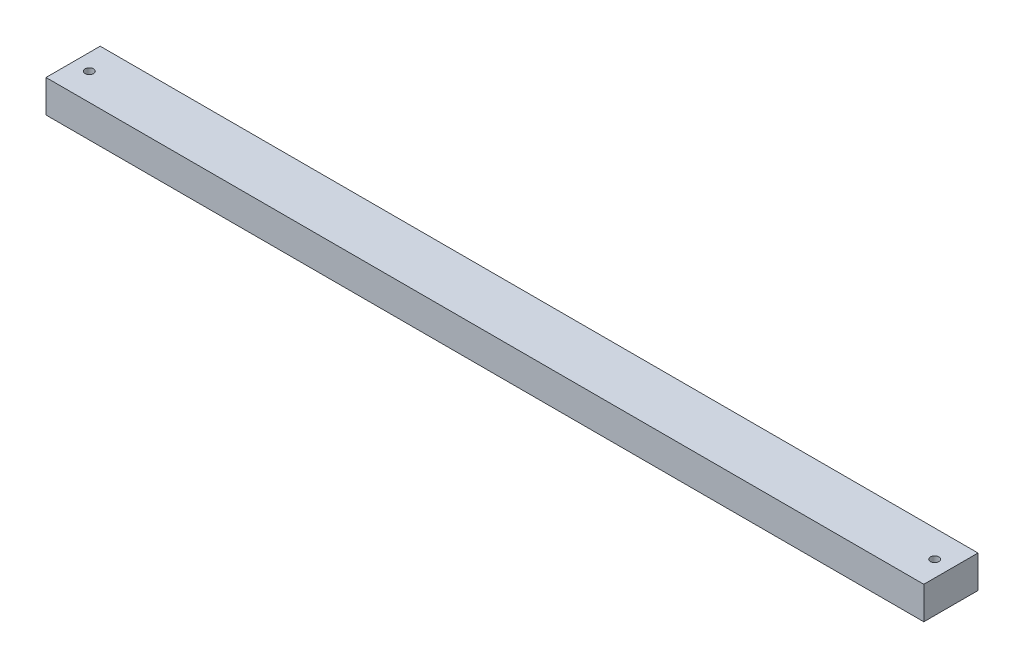
ISO-10303-21;
HEADER;
FILE_DESCRIPTION(('STEP AP214'),'2;1');
FILE_NAME('part.step','',(''),(''),'','','');
FILE_SCHEMA(('AUTOMOTIVE_DESIGN { 1 0 10303 214 1 1 1 1 }'));
ENDSEC;
DATA;
#1=APPLICATION_CONTEXT('core data for automotive mechanical design processes');
#2=APPLICATION_PROTOCOL_DEFINITION('international standard','automotive_design',2000,#1);
#3=PRODUCT_CONTEXT('',#1,'mechanical');
#4=PRODUCT('Part','Part','',(#3));
#5=PRODUCT_RELATED_PRODUCT_CATEGORY('part','',(#4));
#6=PRODUCT_DEFINITION_FORMATION('','',#4);
#7=PRODUCT_DEFINITION_CONTEXT('part definition',#1,'design');
#8=PRODUCT_DEFINITION('design','',#6,#7);
#9=PRODUCT_DEFINITION_SHAPE('','',#8);
#10=(LENGTH_UNIT() NAMED_UNIT(*) SI_UNIT(.MILLI.,.METRE.));
#11=(NAMED_UNIT(*) PLANE_ANGLE_UNIT() SI_UNIT($,.RADIAN.));
#12=(NAMED_UNIT(*) SI_UNIT($,.STERADIAN.) SOLID_ANGLE_UNIT());
#13=UNCERTAINTY_MEASURE_WITH_UNIT(LENGTH_MEASURE(1.E-05),#10,'distance_accuracy_value','');
#14=(GEOMETRIC_REPRESENTATION_CONTEXT(3) GLOBAL_UNCERTAINTY_ASSIGNED_CONTEXT((#13)) GLOBAL_UNIT_ASSIGNED_CONTEXT((#10,
#11,#12)) REPRESENTATION_CONTEXT('',''));
#15=CARTESIAN_POINT('',(0.,0.,0.));
#16=DIRECTION('',(0.,0.,1.));
#17=DIRECTION('',(1.,0.,0.));
#18=AXIS2_PLACEMENT_3D('',#15,#16,#17);
#19=CARTESIAN_POINT('',(162.,12.,-10.));
#20=DIRECTION('',(-1.,0.,0.));
#21=DIRECTION('',(0.,0.,1.));
#22=AXIS2_PLACEMENT_3D('',#19,#20,#21);
#23=PLANE('',#22);
#24=DIRECTION('',(0.,0.,-1.));
#25=VECTOR('',#24,1.);
#26=CARTESIAN_POINT('',(162.,0.,-10.));
#27=LINE('',#26,#25);
#28=CARTESIAN_POINT('',(162.,0.,10.));
#29=VERTEX_POINT('',#28);
#30=CARTESIAN_POINT('',(162.,0.,-10.));
#31=VERTEX_POINT('',#30);
#32=EDGE_CURVE('E96',#29,#31,#27,.T.);
#33=ORIENTED_EDGE('',*,*,#32,.T.);
#34=DIRECTION('',(0.,-1.,0.));
#35=VECTOR('',#34,1.);
#36=CARTESIAN_POINT('',(162.,12.,-10.));
#37=LINE('',#36,#35);
#38=CARTESIAN_POINT('',(162.,12.,-10.));
#39=VERTEX_POINT('',#38);
#40=EDGE_CURVE('E11',#39,#31,#37,.T.);
#41=ORIENTED_EDGE('',*,*,#40,.F.);
#42=DIRECTION('',(0.,0.,-1.));
#43=VECTOR('',#42,1.);
#44=CARTESIAN_POINT('',(162.,12.,-10.));
#45=LINE('',#44,#43);
#46=CARTESIAN_POINT('',(162.,12.,10.));
#47=VERTEX_POINT('',#46);
#48=EDGE_CURVE('E84',#47,#39,#45,.T.);
#49=ORIENTED_EDGE('',*,*,#48,.F.);
#50=DIRECTION('',(0.,-1.,0.));
#51=VECTOR('',#50,1.);
#52=CARTESIAN_POINT('',(162.,12.,10.));
#53=LINE('',#52,#51);
#54=EDGE_CURVE('E92',#47,#29,#53,.T.);
#55=ORIENTED_EDGE('',*,*,#54,.T.);
#56=EDGE_LOOP('',(#33,#41,#49,#55));
#57=FACE_BOUND('',#56,.T.);
#58=ADVANCED_FACE('F33',(#57),#23,.F.);
#59=CARTESIAN_POINT('',(-162.,12.,-10.));
#60=DIRECTION('',(0.,0.,1.));
#61=DIRECTION('',(1.,0.,0.));
#62=AXIS2_PLACEMENT_3D('',#59,#60,#61);
#63=PLANE('',#62);
#64=DIRECTION('',(-1.,0.,0.));
#65=VECTOR('',#64,1.);
#66=CARTESIAN_POINT('',(-162.,0.,-10.));
#67=LINE('',#66,#65);
#68=CARTESIAN_POINT('',(-162.,0.,-10.));
#69=VERTEX_POINT('',#68);
#70=EDGE_CURVE('E88',#31,#69,#67,.T.);
#71=ORIENTED_EDGE('',*,*,#70,.T.);
#72=DIRECTION('',(0.,-1.,0.));
#73=VECTOR('',#72,1.);
#74=CARTESIAN_POINT('',(-162.,12.,-10.));
#75=LINE('',#74,#73);
#76=CARTESIAN_POINT('',(-162.,12.,-10.));
#77=VERTEX_POINT('',#76);
#78=EDGE_CURVE('E41',#77,#69,#75,.T.);
#79=ORIENTED_EDGE('',*,*,#78,.F.);
#80=DIRECTION('',(-1.,0.,0.));
#81=VECTOR('',#80,1.);
#82=CARTESIAN_POINT('',(-162.,12.,-10.));
#83=LINE('',#82,#81);
#84=EDGE_CURVE('E79',#39,#77,#83,.T.);
#85=ORIENTED_EDGE('',*,*,#84,.F.);
#86=ORIENTED_EDGE('',*,*,#40,.T.);
#87=EDGE_LOOP('',(#71,#79,#85,#86));
#88=FACE_BOUND('',#87,.T.);
#89=ADVANCED_FACE('F87',(#88),#63,.F.);
#90=CARTESIAN_POINT('',(-162.,12.,-10.));
#91=DIRECTION('',(1.,0.,0.));
#92=DIRECTION('',(0.,0.,-1.));
#93=AXIS2_PLACEMENT_3D('',#90,#91,#92);
#94=PLANE('',#93);
#95=DIRECTION('',(0.,0.,1.));
#96=VECTOR('',#95,1.);
#97=CARTESIAN_POINT('',(-162.,0.,-10.));
#98=LINE('',#97,#96);
#99=CARTESIAN_POINT('',(-162.,0.,10.));
#100=VERTEX_POINT('',#99);
#101=EDGE_CURVE('E66',#69,#100,#98,.T.);
#102=ORIENTED_EDGE('',*,*,#101,.T.);
#103=DIRECTION('',(0.,-1.,0.));
#104=VECTOR('',#103,1.);
#105=CARTESIAN_POINT('',(-162.,12.,10.));
#106=LINE('',#105,#104);
#107=CARTESIAN_POINT('',(-162.,12.,10.));
#108=VERTEX_POINT('',#107);
#109=EDGE_CURVE('E89',#108,#100,#106,.T.);
#110=ORIENTED_EDGE('',*,*,#109,.F.);
#111=DIRECTION('',(0.,0.,1.));
#112=VECTOR('',#111,1.);
#113=CARTESIAN_POINT('',(-162.,12.,-10.));
#114=LINE('',#113,#112);
#115=EDGE_CURVE('E82',#77,#108,#114,.T.);
#116=ORIENTED_EDGE('',*,*,#115,.F.);
#117=ORIENTED_EDGE('',*,*,#78,.T.);
#118=EDGE_LOOP('',(#102,#110,#116,#117));
#119=FACE_BOUND('',#118,.T.);
#120=ADVANCED_FACE('F90',(#119),#94,.F.);
#121=CARTESIAN_POINT('',(-162.,12.,10.));
#122=DIRECTION('',(0.,0.,-1.));
#123=DIRECTION('',(-1.,0.,0.));
#124=AXIS2_PLACEMENT_3D('',#121,#122,#123);
#125=PLANE('',#124);
#126=DIRECTION('',(1.,0.,0.));
#127=VECTOR('',#126,1.);
#128=CARTESIAN_POINT('',(-162.,0.,10.));
#129=LINE('',#128,#127);
#130=EDGE_CURVE('E72',#100,#29,#129,.T.);
#131=ORIENTED_EDGE('',*,*,#130,.T.);
#132=ORIENTED_EDGE('',*,*,#54,.F.);
#133=DIRECTION('',(1.,0.,0.));
#134=VECTOR('',#133,1.);
#135=CARTESIAN_POINT('',(-162.,12.,10.));
#136=LINE('',#135,#134);
#137=EDGE_CURVE('E49',#108,#47,#136,.T.);
#138=ORIENTED_EDGE('',*,*,#137,.F.);
#139=ORIENTED_EDGE('',*,*,#109,.T.);
#140=EDGE_LOOP('',(#131,#132,#138,#139));
#141=FACE_BOUND('',#140,.T.);
#142=ADVANCED_FACE('F104',(#141),#125,.F.);
#143=CARTESIAN_POINT('',(0.,12.,0.));
#144=DIRECTION('',(0.,1.,0.));
#145=DIRECTION('',(0.,0.,1.));
#146=AXIS2_PLACEMENT_3D('',#143,#144,#145);
#147=PLANE('',#146);
#148=CARTESIAN_POINT('',(156.,12.,0.));
#149=DIRECTION('',(0.,1.,0.));
#150=DIRECTION('',(0.,0.,1.));
#151=AXIS2_PLACEMENT_3D('',#148,#149,#150);
#152=CIRCLE('',#151,1.54999999999999);
#153=CARTESIAN_POINT('',(156.,12.,1.54999999999999));
#154=VERTEX_POINT('',#153);
#155=EDGE_CURVE('E116',#154,#154,#152,.T.);
#156=ORIENTED_EDGE('',*,*,#155,.F.);
#157=EDGE_LOOP('',(#156));
#158=FACE_BOUND('',#157,.T.);
#159=CARTESIAN_POINT('',(-156.,12.,0.));
#160=DIRECTION('',(0.,1.,0.));
#161=DIRECTION('',(0.,0.,1.));
#162=AXIS2_PLACEMENT_3D('',#159,#160,#161);
#163=CIRCLE('',#162,1.54999999999999);
#164=CARTESIAN_POINT('',(-156.,12.,1.54999999999999));
#165=VERTEX_POINT('',#164);
#166=EDGE_CURVE('E110',#165,#165,#163,.T.);
#167=ORIENTED_EDGE('',*,*,#166,.F.);
#168=EDGE_LOOP('',(#167));
#169=FACE_BOUND('',#168,.T.);
#170=ORIENTED_EDGE('',*,*,#48,.T.);
#171=ORIENTED_EDGE('',*,*,#84,.T.);
#172=ORIENTED_EDGE('',*,*,#115,.T.);
#173=ORIENTED_EDGE('',*,*,#137,.T.);
#174=EDGE_LOOP('',(#170,#171,#172,#173));
#175=FACE_BOUND('',#174,.T.);
#176=ADVANCED_FACE('F80',(#158,#169,#175),#147,.T.);
#177=CARTESIAN_POINT('',(0.,0.,0.));
#178=DIRECTION('',(0.,1.,0.));
#179=DIRECTION('',(0.,0.,1.));
#180=AXIS2_PLACEMENT_3D('',#177,#178,#179);
#181=PLANE('',#180);
#182=CARTESIAN_POINT('',(156.,0.,0.));
#183=DIRECTION('',(0.,1.,0.));
#184=DIRECTION('',(0.,0.,1.));
#185=AXIS2_PLACEMENT_3D('',#182,#183,#184);
#186=CIRCLE('',#185,1.54999999999999);
#187=CARTESIAN_POINT('',(156.,0.,1.54999999999999));
#188=VERTEX_POINT('',#187);
#189=EDGE_CURVE('E113',#188,#188,#186,.T.);
#190=ORIENTED_EDGE('',*,*,#189,.T.);
#191=EDGE_LOOP('',(#190));
#192=FACE_BOUND('',#191,.T.);
#193=CARTESIAN_POINT('',(-156.,0.,0.));
#194=DIRECTION('',(0.,1.,0.));
#195=DIRECTION('',(0.,0.,1.));
#196=AXIS2_PLACEMENT_3D('',#193,#194,#195);
#197=CIRCLE('',#196,1.54999999999999);
#198=CARTESIAN_POINT('',(-156.,0.,1.54999999999999));
#199=VERTEX_POINT('',#198);
#200=EDGE_CURVE('E99',#199,#199,#197,.T.);
#201=ORIENTED_EDGE('',*,*,#200,.T.);
#202=EDGE_LOOP('',(#201));
#203=FACE_BOUND('',#202,.T.);
#204=ORIENTED_EDGE('',*,*,#32,.F.);
#205=ORIENTED_EDGE('',*,*,#130,.F.);
#206=ORIENTED_EDGE('',*,*,#101,.F.);
#207=ORIENTED_EDGE('',*,*,#70,.F.);
#208=EDGE_LOOP('',(#204,#205,#206,#207));
#209=FACE_BOUND('',#208,.T.);
#210=ADVANCED_FACE('F107',(#192,#203,#209),#181,.F.);
#211=CARTESIAN_POINT('',(-156.,0.,0.));
#212=DIRECTION('',(0.,1.,0.));
#213=DIRECTION('',(0.,0.,1.));
#214=AXIS2_PLACEMENT_3D('',#211,#212,#213);
#215=CYLINDRICAL_SURFACE('',#214,1.54999999999999);
#216=ORIENTED_EDGE('',*,*,#200,.F.);
#217=EDGE_LOOP('',(#216));
#218=FACE_BOUND('',#217,.T.);
#219=ORIENTED_EDGE('',*,*,#166,.T.);
#220=EDGE_LOOP('',(#219));
#221=FACE_BOUND('',#220,.T.);
#222=ADVANCED_FACE('F127',(#218,#221),#215,.F.);
#223=CARTESIAN_POINT('',(156.,0.,0.));
#224=DIRECTION('',(0.,1.,0.));
#225=DIRECTION('',(0.,0.,1.));
#226=AXIS2_PLACEMENT_3D('',#223,#224,#225);
#227=CYLINDRICAL_SURFACE('',#226,1.54999999999999);
#228=ORIENTED_EDGE('',*,*,#189,.F.);
#229=EDGE_LOOP('',(#228));
#230=FACE_BOUND('',#229,.T.);
#231=ORIENTED_EDGE('',*,*,#155,.T.);
#232=EDGE_LOOP('',(#231));
#233=FACE_BOUND('',#232,.T.);
#234=ADVANCED_FACE('F124',(#230,#233),#227,.F.);
#235=CLOSED_SHELL('',(#58,#89,#120,#142,#176,#210,#222,#234));
#236=MANIFOLD_SOLID_BREP('B2',#235);
#237=ADVANCED_BREP_SHAPE_REPRESENTATION('',(#18,#236),#14);
#238=SHAPE_DEFINITION_REPRESENTATION(#9,#237);
ENDSEC;
END-ISO-10303-21;
